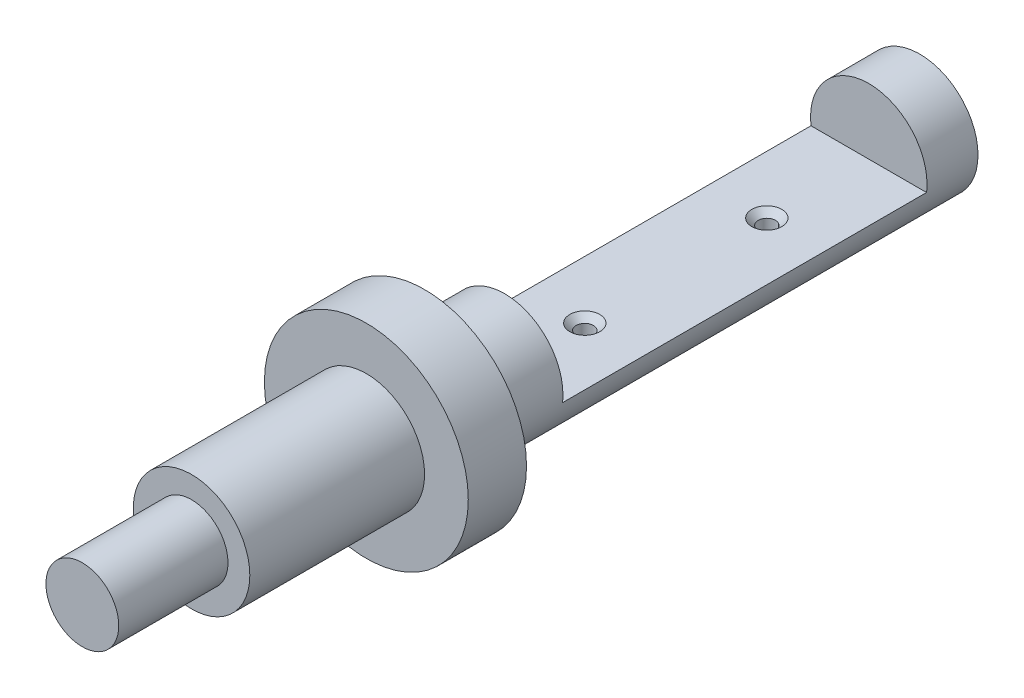
ISO-10303-21;
HEADER;
FILE_DESCRIPTION(('STEP AP214'),'2;1');
FILE_NAME('part.step','',(''),(''),'','','');
FILE_SCHEMA(('AUTOMOTIVE_DESIGN { 1 0 10303 214 1 1 1 1 }'));
ENDSEC;
DATA;
#1=APPLICATION_CONTEXT('core data for automotive mechanical design processes');
#2=APPLICATION_PROTOCOL_DEFINITION('international standard','automotive_design',2000,#1);
#3=PRODUCT_CONTEXT('',#1,'mechanical');
#4=PRODUCT('Part','Part','',(#3));
#5=PRODUCT_RELATED_PRODUCT_CATEGORY('part','',(#4));
#6=PRODUCT_DEFINITION_FORMATION('','',#4);
#7=PRODUCT_DEFINITION_CONTEXT('part definition',#1,'design');
#8=PRODUCT_DEFINITION('design','',#6,#7);
#9=PRODUCT_DEFINITION_SHAPE('','',#8);
#10=(LENGTH_UNIT() NAMED_UNIT(*) SI_UNIT(.MILLI.,.METRE.));
#11=(NAMED_UNIT(*) PLANE_ANGLE_UNIT() SI_UNIT($,.RADIAN.));
#12=(NAMED_UNIT(*) SI_UNIT($,.STERADIAN.) SOLID_ANGLE_UNIT());
#13=UNCERTAINTY_MEASURE_WITH_UNIT(LENGTH_MEASURE(1.E-05),#10,'distance_accuracy_value','');
#14=(GEOMETRIC_REPRESENTATION_CONTEXT(3) GLOBAL_UNCERTAINTY_ASSIGNED_CONTEXT((#13)) GLOBAL_UNIT_ASSIGNED_CONTEXT((#10,
#11,#12)) REPRESENTATION_CONTEXT('',''));
#15=CARTESIAN_POINT('',(0.,0.,0.));
#16=DIRECTION('',(0.,0.,1.));
#17=DIRECTION('',(1.,0.,0.));
#18=AXIS2_PLACEMENT_3D('',#15,#16,#17);
#19=CARTESIAN_POINT('',(0.,0.,34.));
#20=DIRECTION('',(0.,0.,-1.));
#21=DIRECTION('',(-1.,0.,0.));
#22=AXIS2_PLACEMENT_3D('',#19,#20,#21);
#23=CYLINDRICAL_SURFACE('',#22,8.);
#24=CARTESIAN_POINT('',(0.,-8.,13.18745));
#25=CARTESIAN_POINT('',(0.0663087482033811,-7.99999894501209,13.18744725931));
#26=CARTESIAN_POINT('',(0.132656173743971,-7.99916694623629,13.1818771013111));
#27=CARTESIAN_POINT('',(0.263497078716653,-7.99592800887379,13.1597489626041));
#28=CARTESIAN_POINT('',(0.327988679617249,-7.9935195292754,13.1431802305537));
#29=CARTESIAN_POINT('',(0.453205425983684,-7.98739833453829,13.0995604552694));
#30=CARTESIAN_POINT('',(0.5139333576356,-7.98368659808316,13.0725172762774));
#31=CARTESIAN_POINT('',(0.629979888221841,-7.97536921624044,13.0087353503261));
#32=CARTESIAN_POINT('',(0.685299248817819,-7.97076369699322,12.971997971255));
#33=CARTESIAN_POINT('',(0.789391275249504,-7.96113160914156,12.8895707407477));
#34=CARTESIAN_POINT('',(0.838116535854177,-7.95610237418402,12.8438213295778));
#35=CARTESIAN_POINT('',(0.927228275362013,-7.94621059285846,12.7447968459276));
#36=CARTESIAN_POINT('',(0.967614278557428,-7.94134805601284,12.6915213444179));
#37=CARTESIAN_POINT('',(1.03908511700861,-7.93231433212592,12.5786391353847));
#38=CARTESIAN_POINT('',(1.07012418041902,-7.9281465905078,12.519003147994));
#39=CARTESIAN_POINT('',(1.12172755937181,-7.9210106727804,12.3952921876835));
#40=CARTESIAN_POINT('',(1.14229243383083,-7.91804243266586,12.3312174518284));
#41=CARTESIAN_POINT('',(1.17221665360042,-7.91366776117878,12.2009459974442));
#42=CARTESIAN_POINT('',(1.18165708849378,-7.91225003315492,12.1347682919936));
#43=CARTESIAN_POINT('',(1.18931563833385,-7.91110259325201,12.0017540090907));
#44=CARTESIAN_POINT('',(1.18753438441178,-7.91137278644073,11.9349174689038));
#45=CARTESIAN_POINT('',(1.17286640774963,-7.91356032981611,11.8030550620849));
#46=CARTESIAN_POINT('',(1.16006993123018,-7.91546429433811,11.7380189027145));
#47=CARTESIAN_POINT('',(1.12387599416658,-7.92068394369203,11.6110271665926));
#48=CARTESIAN_POINT('',(1.10047823944774,-7.9239996676987,11.5490716753793));
#49=CARTESIAN_POINT('',(1.04365184816744,-7.93168404973752,11.4297249933783));
#50=CARTESIAN_POINT('',(1.0101849186723,-7.93605671459313,11.3723523041544));
#51=CARTESIAN_POINT('',(0.934197460537265,-7.94535937988534,11.2640028837719));
#52=CARTESIAN_POINT('',(0.891676349874277,-7.95028941614145,11.2130265641212));
#53=CARTESIAN_POINT('',(0.798291848354108,-7.96021050048746,11.1183938268324));
#54=CARTESIAN_POINT('',(0.747350853250369,-7.96520167332707,11.0748139664742));
#55=CARTESIAN_POINT('',(0.638837289405928,-7.97463779998068,10.9968104365116));
#56=CARTESIAN_POINT('',(0.58126469270914,-7.97908275149189,10.9623868055082));
#57=CARTESIAN_POINT('',(0.461056338086196,-7.98693011537415,10.9036692215213));
#58=CARTESIAN_POINT('',(0.398417690200602,-7.99033192730269,10.8793810997559));
#59=CARTESIAN_POINT('',(0.269888941365808,-7.99570467491202,10.8416901483312));
#60=CARTESIAN_POINT('',(0.203999055919608,-7.99767570529413,10.828286598231));
#61=CARTESIAN_POINT('',(0.0714990296717954,-7.99995228149022,10.8128468933002));
#62=CARTESIAN_POINT('',(0.00490141015273311,-8.00027324948121,10.8107054735024));
#63=CARTESIAN_POINT('',(-0.127702010956079,-7.99925549396797,10.8175715193873));
#64=CARTESIAN_POINT('',(-0.193707830413773,-7.99791682074365,10.8265786473176));
#65=CARTESIAN_POINT('',(-0.322935698645108,-7.99373973915741,10.8553985815482));
#66=CARTESIAN_POINT('',(-0.386169417671419,-7.99090844032015,10.8751601775316));
#67=CARTESIAN_POINT('',(-0.50842601708223,-7.98406257715895,10.924874136789));
#68=CARTESIAN_POINT('',(-0.567448703137571,-7.98004795827142,10.9548269699967));
#69=CARTESIAN_POINT('',(-0.680071166744436,-7.97124334983544,11.0243206340977));
#70=CARTESIAN_POINT('',(-0.733629262322739,-7.96644803413886,11.0639283282556));
#71=CARTESIAN_POINT('',(-0.833375733721929,-7.95663255175364,11.1515142049128));
#72=CARTESIAN_POINT('',(-0.879563690326868,-7.95161237229547,11.1994928632305));
#73=CARTESIAN_POINT('',(-0.963641154777775,-7.94186415414887,11.3029270243767));
#74=CARTESIAN_POINT('',(-1.00146015110145,-7.93713882206323,11.3584401369775));
#75=CARTESIAN_POINT('',(-1.06723623844724,-7.92856302980426,11.4750928648228));
#76=CARTESIAN_POINT('',(-1.09519359154069,-7.92471254638295,11.5362323304936));
#77=CARTESIAN_POINT('',(-1.14034316959154,-7.91834193722381,11.6621908133552));
#78=CARTESIAN_POINT('',(-1.15757267972105,-7.91581720860529,11.7269962227029));
#79=CARTESIAN_POINT('',(-1.18089625882434,-7.91237166547568,11.8586210634354));
#80=CARTESIAN_POINT('',(-1.18699107940642,-7.91145074270549,11.9254403585703));
#81=CARTESIAN_POINT('',(-1.18785466598699,-7.91132106551878,12.0584935036754));
#82=CARTESIAN_POINT('',(-1.18273429252525,-7.91209555218728,12.124726644458));
#83=CARTESIAN_POINT('',(-1.16155021737211,-7.91523303304493,12.2553787970403));
#84=CARTESIAN_POINT('',(-1.1454865317767,-7.91759602489762,12.3197978115081));
#85=CARTESIAN_POINT('',(-1.10291072354192,-7.92363845312516,12.444963454484));
#86=CARTESIAN_POINT('',(-1.07640618820217,-7.92731693336437,12.5057127128896));
#87=CARTESIAN_POINT('',(-1.01371206095952,-7.93557705576351,12.6219200795363));
#88=CARTESIAN_POINT('',(-0.977522154897857,-7.94015872721845,12.6773780160667));
#89=CARTESIAN_POINT('',(-0.896081213857096,-7.94976293640523,12.7819919896461));
#90=CARTESIAN_POINT('',(-0.850748030462223,-7.9547892207032,12.8310837382069));
#91=CARTESIAN_POINT('',(-0.752480938996389,-7.96468491851204,12.9210026984493));
#92=CARTESIAN_POINT('',(-0.699545265257733,-7.96955429525879,12.9618279849339));
#93=CARTESIAN_POINT('',(-0.587240998054782,-7.9786174236364,13.0342509876264));
#94=CARTESIAN_POINT('',(-0.527839306602324,-7.98280739684649,13.0657978431009));
#95=CARTESIAN_POINT('',(-0.404546657243038,-7.99000251399306,13.118419737412));
#96=CARTESIAN_POINT('',(-0.340660443721612,-7.99300888850096,13.1395056583065));
#97=CARTESIAN_POINT('',(-0.230403820004135,-7.99680919356762,13.1658055316249));
#98=CARTESIAN_POINT('',(-0.18471505570066,-7.99799962230652,13.1739098535637));
#99=CARTESIAN_POINT('',(-0.0926904896549038,-7.99959538955319,13.1847330133001));
#100=CARTESIAN_POINT('',(-0.0463546957103452,-8.0000007375142,13.187451915944));
#101=CARTESIAN_POINT('',(0.,-8.,13.18745));
#102=B_SPLINE_CURVE_WITH_KNOTS('',3,(#24,#25,#26,#27,#28,#29,#30,#31,#32,#33,#34,#35,#36,#37,
#38,#39,#40,#41,#42,#43,#44,#45,#46,#47,#48,#49,#50,#51,#52,#53,#54,#55,#56,#57,#58,#59,#60,#61,
#62,#63,#64,#65,#66,#67,#68,#69,#70,#71,#72,#73,#74,#75,#76,#77,#78,#79,#80,#81,#82,#83,#84,#85,
#86,#87,#88,#89,#90,#91,#92,#93,#94,#95,#96,#97,#98,#99,#100,#101),.UNSPECIFIED.,.T.,.F.,(4,2,2,
2,2,2,2,2,2,2,2,2,2,2,2,2,2,2,2,2,2,2,2,2,2,2,2,2,2,2,2,2,2,2,2,2,2,2,4),(0.,0.198756864090689,
0.397708303954101,0.596510659210654,0.795284977691535,0.995419938242138,1.19556631221499,
1.39667743202899,1.59777781916165,1.79740307109577,1.99701709578881,2.19501110853492,
2.39301061574971,2.59177284019067,2.79054784537296,2.99126908869506,3.19199117820572,
3.39282858959272,3.59365270663385,3.79259637960535,3.99153402559794,4.18953256076507,
4.38754022719161,4.58696019731304,4.78639150646816,4.98744402144124,5.1884911930786,
5.38883565636561,5.58916659560021,5.78752623732373,5.98588558729017,6.18410105589672,
6.38232295468304,6.58241219704049,6.78254798521854,6.98376122319847,7.18476470654093,
7.32371205731247,7.462657734993),.UNSPECIFIED.);
#103=CARTESIAN_POINT('',(0.,-8.,13.18745));
#104=VERTEX_POINT('',#103);
#105=EDGE_CURVE('E42',#104,#104,#102,.T.);
#106=ORIENTED_EDGE('',*,*,#105,.T.);
#107=EDGE_LOOP('',(#106));
#108=FACE_BOUND('',#107,.T.);
#109=CARTESIAN_POINT('',(0.,-8.,-11.81255));
#110=CARTESIAN_POINT('',(0.0663087482033812,-7.99999894501209,-11.81255274069));
#111=CARTESIAN_POINT('',(0.132656173743971,-7.99916694623629,-11.8181228986889));
#112=CARTESIAN_POINT('',(0.263497078716653,-7.99592800887379,-11.8402510373959));
#113=CARTESIAN_POINT('',(0.327988679617249,-7.9935195292754,-11.8568197694463));
#114=CARTESIAN_POINT('',(0.453205425983684,-7.98739833453829,-11.9004395447306));
#115=CARTESIAN_POINT('',(0.5139333576356,-7.98368659808316,-11.9274827237226));
#116=CARTESIAN_POINT('',(0.62997988822184,-7.97536921624044,-11.9912646496739));
#117=CARTESIAN_POINT('',(0.685299248817819,-7.97076369699322,-12.028002028745));
#118=CARTESIAN_POINT('',(0.789391275249503,-7.96113160914156,-12.1104292592523));
#119=CARTESIAN_POINT('',(0.838116535854176,-7.95610237418402,-12.1561786704222));
#120=CARTESIAN_POINT('',(0.927228275362013,-7.94621059285846,-12.2552031540724));
#121=CARTESIAN_POINT('',(0.967614278557428,-7.94134805601284,-12.3084786555821));
#122=CARTESIAN_POINT('',(1.03908511700861,-7.93231433212592,-12.4213608646153));
#123=CARTESIAN_POINT('',(1.07012418041902,-7.9281465905078,-12.480996852006));
#124=CARTESIAN_POINT('',(1.12172755937181,-7.9210106727804,-12.6047078123165));
#125=CARTESIAN_POINT('',(1.14229243383083,-7.91804243266586,-12.6687825481716));
#126=CARTESIAN_POINT('',(1.17221665360042,-7.91366776117878,-12.7990540025558));
#127=CARTESIAN_POINT('',(1.18165708849378,-7.91225003315492,-12.8652317080064));
#128=CARTESIAN_POINT('',(1.18931563833385,-7.911102593252,-12.9982459909093));
#129=CARTESIAN_POINT('',(1.18753438441178,-7.91137278644073,-13.0650825310962));
#130=CARTESIAN_POINT('',(1.17286640774963,-7.91356032981611,-13.1969449379151));
#131=CARTESIAN_POINT('',(1.16006993123018,-7.91546429433811,-13.2619810972855));
#132=CARTESIAN_POINT('',(1.12387599416658,-7.92068394369203,-13.3889728334074));
#133=CARTESIAN_POINT('',(1.10047823944774,-7.9239996676987,-13.4509283246207));
#134=CARTESIAN_POINT('',(1.04365184816744,-7.93168404973752,-13.5702750066217));
#135=CARTESIAN_POINT('',(1.0101849186723,-7.93605671459313,-13.6276476958456));
#136=CARTESIAN_POINT('',(0.934197460537265,-7.94535937988534,-13.7359971162281));
#137=CARTESIAN_POINT('',(0.891676349874277,-7.95028941614145,-13.7869734358788));
#138=CARTESIAN_POINT('',(0.798291848354108,-7.96021050048746,-13.8816061731676));
#139=CARTESIAN_POINT('',(0.747350853250369,-7.96520167332707,-13.9251860335258));
#140=CARTESIAN_POINT('',(0.638837289405928,-7.97463779998068,-14.0031895634884));
#141=CARTESIAN_POINT('',(0.58126469270914,-7.97908275149189,-14.0376131944918));
#142=CARTESIAN_POINT('',(0.461056338086196,-7.98693011537415,-14.0963307784787));
#143=CARTESIAN_POINT('',(0.398417690200602,-7.99033192730269,-14.1206189002441));
#144=CARTESIAN_POINT('',(0.269888941365808,-7.99570467491202,-14.1583098516688));
#145=CARTESIAN_POINT('',(0.203999055919608,-7.99767570529413,-14.171713401769));
#146=CARTESIAN_POINT('',(0.0714990296717954,-7.99995228149022,-14.1871531066998));
#147=CARTESIAN_POINT('',(0.00490141015273312,-8.00027324948121,-14.1892945264976));
#148=CARTESIAN_POINT('',(-0.127702010956079,-7.99925549396797,-14.1824284806127));
#149=CARTESIAN_POINT('',(-0.193707830413773,-7.99791682074365,-14.1734213526824));
#150=CARTESIAN_POINT('',(-0.322935698645108,-7.99373973915741,-14.1446014184518));
#151=CARTESIAN_POINT('',(-0.386169417671419,-7.99090844032015,-14.1248398224684));
#152=CARTESIAN_POINT('',(-0.508426017082229,-7.98406257715895,-14.075125863211));
#153=CARTESIAN_POINT('',(-0.567448703137571,-7.98004795827142,-14.0451730300033));
#154=CARTESIAN_POINT('',(-0.680071166744436,-7.97124334983544,-13.9756793659023));
#155=CARTESIAN_POINT('',(-0.73362926232274,-7.96644803413886,-13.9360716717444));
#156=CARTESIAN_POINT('',(-0.833375733721929,-7.95663255175364,-13.8484857950872));
#157=CARTESIAN_POINT('',(-0.879563690326868,-7.95161237229547,-13.8005071367695));
#158=CARTESIAN_POINT('',(-0.963641154777775,-7.94186415414887,-13.6970729756233));
#159=CARTESIAN_POINT('',(-1.00146015110145,-7.93713882206323,-13.6415598630225));
#160=CARTESIAN_POINT('',(-1.06723623844724,-7.92856302980426,-13.5249071351772));
#161=CARTESIAN_POINT('',(-1.09519359154069,-7.92471254638295,-13.4637676695064));
#162=CARTESIAN_POINT('',(-1.14034316959154,-7.91834193722381,-13.3378091866448));
#163=CARTESIAN_POINT('',(-1.15757267972105,-7.91581720860529,-13.2730037772971));
#164=CARTESIAN_POINT('',(-1.18089625882434,-7.91237166547568,-13.1413789365646));
#165=CARTESIAN_POINT('',(-1.18699107940642,-7.91145074270549,-13.0745596414297));
#166=CARTESIAN_POINT('',(-1.18785466598699,-7.91132106551878,-12.9415064963246));
#167=CARTESIAN_POINT('',(-1.18273429252525,-7.91209555218728,-12.875273355542));
#168=CARTESIAN_POINT('',(-1.16155021737211,-7.91523303304493,-12.7446212029597));
#169=CARTESIAN_POINT('',(-1.1454865317767,-7.91759602489762,-12.6802021884919));
#170=CARTESIAN_POINT('',(-1.10291072354192,-7.92363845312516,-12.555036545516));
#171=CARTESIAN_POINT('',(-1.07640618820217,-7.92731693336437,-12.4942872871104));
#172=CARTESIAN_POINT('',(-1.01371206095952,-7.93557705576351,-12.3780799204637));
#173=CARTESIAN_POINT('',(-0.977522154897857,-7.94015872721845,-12.3226219839333));
#174=CARTESIAN_POINT('',(-0.896081213857096,-7.94976293640523,-12.2180080103539));
#175=CARTESIAN_POINT('',(-0.850748030462223,-7.9547892207032,-12.1689162617931));
#176=CARTESIAN_POINT('',(-0.752480938996389,-7.96468491851204,-12.0789973015507));
#177=CARTESIAN_POINT('',(-0.699545265257733,-7.96955429525879,-12.0381720150661));
#178=CARTESIAN_POINT('',(-0.587240998054782,-7.9786174236364,-11.9657490123736));
#179=CARTESIAN_POINT('',(-0.527839306602324,-7.98280739684649,-11.9342021568991));
#180=CARTESIAN_POINT('',(-0.404546657243038,-7.99000251399306,-11.881580262588));
#181=CARTESIAN_POINT('',(-0.340660443721612,-7.99300888850096,-11.8604943416935));
#182=CARTESIAN_POINT('',(-0.230403820004135,-7.99680919356762,-11.8341944683751));
#183=CARTESIAN_POINT('',(-0.18471505570066,-7.99799962230652,-11.8260901464363));
#184=CARTESIAN_POINT('',(-0.0926904896549038,-7.99959538955319,-11.8152669866999));
#185=CARTESIAN_POINT('',(-0.0463546957103452,-8.0000007375142,-11.812548084056));
#186=CARTESIAN_POINT('',(0.,-8.,-11.81255));
#187=B_SPLINE_CURVE_WITH_KNOTS('',3,(#109,#110,#111,#112,#113,#114,#115,#116,#117,#118,#119,
#120,#121,#122,#123,#124,#125,#126,#127,#128,#129,#130,#131,#132,#133,#134,#135,#136,#137,#138,
#139,#140,#141,#142,#143,#144,#145,#146,#147,#148,#149,#150,#151,#152,#153,#154,#155,#156,#157,
#158,#159,#160,#161,#162,#163,#164,#165,#166,#167,#168,#169,#170,#171,#172,#173,#174,#175,#176,
#177,#178,#179,#180,#181,#182,#183,#184,#185,#186),.UNSPECIFIED.,.T.,.F.,(4,2,2,2,2,2,2,2,2,2,2,
2,2,2,2,2,2,2,2,2,2,2,2,2,2,2,2,2,2,2,2,2,2,2,2,2,2,2,4),(0.,0.198756864090689,
0.397708303954101,0.596510659210652,0.795284977691535,0.995419938242136,1.19556631221499,
1.39667743202899,1.59777781916165,1.79740307109576,1.99701709578881,2.19501110853492,
2.39301061574971,2.59177284019067,2.79054784537296,2.99126908869506,3.19199117820572,
3.39282858959272,3.59365270663385,3.79259637960535,3.99153402559794,4.18953256076507,
4.38754022719161,4.58696019731305,4.78639150646816,4.98744402144124,5.1884911930786,
5.38883565636561,5.58916659560021,5.78752623732373,5.98588558729017,6.18410105589672,
6.38232295468304,6.58241219704049,6.78254798521854,6.98376122319847,7.18476470654093,
7.32371205731247,7.462657734993),.UNSPECIFIED.);
#188=CARTESIAN_POINT('',(0.,-8.,-11.81255));
#189=VERTEX_POINT('',#188);
#190=EDGE_CURVE('E85',#189,#189,#187,.T.);
#191=ORIENTED_EDGE('',*,*,#190,.T.);
#192=EDGE_LOOP('',(#191));
#193=FACE_BOUND('',#192,.T.);
#194=CARTESIAN_POINT('',(0.,0.,23.));
#195=DIRECTION('',(0.,0.,1.));
#196=DIRECTION('',(1.,0.,0.));
#197=AXIS2_PLACEMENT_3D('',#194,#195,#196);
#198=CIRCLE('',#197,8.);
#199=CARTESIAN_POINT('',(7.93725393319377,-1.,23.));
#200=VERTEX_POINT('',#199);
#201=CARTESIAN_POINT('',(-7.93725393319377,-1.,23.));
#202=VERTEX_POINT('',#201);
#203=EDGE_CURVE('E51',#200,#202,#198,.T.);
#204=ORIENTED_EDGE('',*,*,#203,.T.);
#205=DIRECTION('',(0.,0.,-1.));
#206=VECTOR('',#205,1.);
#207=CARTESIAN_POINT('',(-7.93725393319377,-1.,34.));
#208=LINE('',#207,#206);
#209=CARTESIAN_POINT('',(-7.93725393319377,-1.,-27.));
#210=VERTEX_POINT('',#209);
#211=EDGE_CURVE('E11',#202,#210,#208,.T.);
#212=ORIENTED_EDGE('',*,*,#211,.T.);
#213=CARTESIAN_POINT('',(0.,0.,-27.));
#214=DIRECTION('',(0.,0.,-1.));
#215=DIRECTION('',(0.,1.,0.));
#216=AXIS2_PLACEMENT_3D('',#213,#214,#215);
#217=CIRCLE('',#216,8.);
#218=CARTESIAN_POINT('',(7.93725393319377,-1.,-27.));
#219=VERTEX_POINT('',#218);
#220=EDGE_CURVE('E70',#210,#219,#217,.T.);
#221=ORIENTED_EDGE('',*,*,#220,.T.);
#222=DIRECTION('',(0.,0.,-1.));
#223=VECTOR('',#222,1.);
#224=CARTESIAN_POINT('',(7.93725393319377,-1.,34.));
#225=LINE('',#224,#223);
#226=EDGE_CURVE('E75',#219,#200,#225,.F.);
#227=ORIENTED_EDGE('',*,*,#226,.T.);
#228=EDGE_LOOP('',(#204,#212,#221,#227));
#229=FACE_BOUND('',#228,.T.);
#230=CARTESIAN_POINT('',(0.,0.,34.));
#231=DIRECTION('',(0.,0.,1.));
#232=DIRECTION('',(1.,0.,0.));
#233=AXIS2_PLACEMENT_3D('',#230,#231,#232);
#234=CIRCLE('',#233,8.);
#235=CARTESIAN_POINT('',(8.,0.,34.));
#236=VERTEX_POINT('',#235);
#237=EDGE_CURVE('E145',#236,#236,#234,.T.);
#238=ORIENTED_EDGE('',*,*,#237,.F.);
#239=EDGE_LOOP('',(#238));
#240=FACE_BOUND('',#239,.T.);
#241=CARTESIAN_POINT('',(0.,0.,-34.));
#242=DIRECTION('',(0.,0.,1.));
#243=DIRECTION('',(1.,0.,0.));
#244=AXIS2_PLACEMENT_3D('',#241,#242,#243);
#245=CIRCLE('',#244,8.);
#246=CARTESIAN_POINT('',(8.,0.,-34.));
#247=VERTEX_POINT('',#246);
#248=EDGE_CURVE('E143',#247,#247,#245,.T.);
#249=ORIENTED_EDGE('',*,*,#248,.T.);
#250=EDGE_LOOP('',(#249));
#251=FACE_BOUND('',#250,.T.);
#252=ADVANCED_FACE('F38',(#108,#193,#229,#240,#251),#23,.T.);
#253=CARTESIAN_POINT('',(0.,0.,-34.));
#254=DIRECTION('',(0.,0.,1.));
#255=DIRECTION('',(1.,0.,0.));
#256=AXIS2_PLACEMENT_3D('',#253,#254,#255);
#257=PLANE('',#256);
#258=ORIENTED_EDGE('',*,*,#248,.F.);
#259=EDGE_LOOP('',(#258));
#260=FACE_BOUND('',#259,.T.);
#261=ADVANCED_FACE('F133',(#260),#257,.F.);
#262=CARTESIAN_POINT('',(0.,0.,42.));
#263=DIRECTION('',(0.,0.,-1.));
#264=DIRECTION('',(-1.,0.,0.));
#265=AXIS2_PLACEMENT_3D('',#262,#263,#264);
#266=CYLINDRICAL_SURFACE('',#265,14.);
#267=CARTESIAN_POINT('',(0.,0.,42.));
#268=DIRECTION('',(0.,0.,1.));
#269=DIRECTION('',(1.,0.,0.));
#270=AXIS2_PLACEMENT_3D('',#267,#268,#269);
#271=CIRCLE('',#270,14.);
#272=CARTESIAN_POINT('',(14.,0.,42.));
#273=VERTEX_POINT('',#272);
#274=EDGE_CURVE('E146',#273,#273,#271,.T.);
#275=ORIENTED_EDGE('',*,*,#274,.F.);
#276=EDGE_LOOP('',(#275));
#277=FACE_BOUND('',#276,.T.);
#278=CARTESIAN_POINT('',(0.,0.,34.));
#279=DIRECTION('',(0.,0.,1.));
#280=DIRECTION('',(1.,0.,0.));
#281=AXIS2_PLACEMENT_3D('',#278,#279,#280);
#282=CIRCLE('',#281,14.);
#283=CARTESIAN_POINT('',(14.,0.,34.));
#284=VERTEX_POINT('',#283);
#285=EDGE_CURVE('E152',#284,#284,#282,.T.);
#286=ORIENTED_EDGE('',*,*,#285,.T.);
#287=EDGE_LOOP('',(#286));
#288=FACE_BOUND('',#287,.T.);
#289=ADVANCED_FACE('F127',(#277,#288),#266,.T.);
#290=CARTESIAN_POINT('',(0.,0.,42.));
#291=DIRECTION('',(0.,0.,1.));
#292=DIRECTION('',(1.,0.,0.));
#293=AXIS2_PLACEMENT_3D('',#290,#291,#292);
#294=PLANE('',#293);
#295=CARTESIAN_POINT('',(0.,0.,42.));
#296=DIRECTION('',(0.,0.,1.));
#297=DIRECTION('',(1.,0.,0.));
#298=AXIS2_PLACEMENT_3D('',#295,#296,#297);
#299=CIRCLE('',#298,8.);
#300=CARTESIAN_POINT('',(8.,0.,42.));
#301=VERTEX_POINT('',#300);
#302=EDGE_CURVE('E149',#301,#301,#299,.T.);
#303=ORIENTED_EDGE('',*,*,#302,.F.);
#304=EDGE_LOOP('',(#303));
#305=FACE_BOUND('',#304,.T.);
#306=ORIENTED_EDGE('',*,*,#274,.T.);
#307=EDGE_LOOP('',(#306));
#308=FACE_BOUND('',#307,.T.);
#309=ADVANCED_FACE('F124',(#305,#308),#294,.T.);
#310=CARTESIAN_POINT('',(0.,0.,34.));
#311=DIRECTION('',(0.,0.,1.));
#312=DIRECTION('',(1.,0.,0.));
#313=AXIS2_PLACEMENT_3D('',#310,#311,#312);
#314=PLANE('',#313);
#315=ORIENTED_EDGE('',*,*,#237,.T.);
#316=EDGE_LOOP('',(#315));
#317=FACE_BOUND('',#316,.T.);
#318=ORIENTED_EDGE('',*,*,#285,.F.);
#319=EDGE_LOOP('',(#318));
#320=FACE_BOUND('',#319,.T.);
#321=ADVANCED_FACE('F122',(#317,#320),#314,.F.);
#322=CARTESIAN_POINT('',(0.,0.,66.));
#323=DIRECTION('',(0.,0.,-1.));
#324=DIRECTION('',(-1.,0.,0.));
#325=AXIS2_PLACEMENT_3D('',#322,#323,#324);
#326=CYLINDRICAL_SURFACE('',#325,8.);
#327=CARTESIAN_POINT('',(0.,0.,66.));
#328=DIRECTION('',(0.,0.,1.));
#329=DIRECTION('',(1.,0.,0.));
#330=AXIS2_PLACEMENT_3D('',#327,#328,#329);
#331=CIRCLE('',#330,8.);
#332=CARTESIAN_POINT('',(8.,0.,66.));
#333=VERTEX_POINT('',#332);
#334=EDGE_CURVE('E165',#333,#333,#331,.T.);
#335=ORIENTED_EDGE('',*,*,#334,.F.);
#336=EDGE_LOOP('',(#335));
#337=FACE_BOUND('',#336,.T.);
#338=ORIENTED_EDGE('',*,*,#302,.T.);
#339=EDGE_LOOP('',(#338));
#340=FACE_BOUND('',#339,.T.);
#341=ADVANCED_FACE('F118',(#337,#340),#326,.T.);
#342=CARTESIAN_POINT('',(0.,0.,66.));
#343=DIRECTION('',(0.,0.,1.));
#344=DIRECTION('',(1.,0.,0.));
#345=AXIS2_PLACEMENT_3D('',#342,#343,#344);
#346=PLANE('',#345);
#347=CARTESIAN_POINT('',(0.,0.,66.));
#348=DIRECTION('',(0.,0.,1.));
#349=DIRECTION('',(1.,0.,0.));
#350=AXIS2_PLACEMENT_3D('',#347,#348,#349);
#351=CIRCLE('',#350,5.);
#352=CARTESIAN_POINT('',(5.,0.,66.));
#353=VERTEX_POINT('',#352);
#354=EDGE_CURVE('E155',#353,#353,#351,.T.);
#355=ORIENTED_EDGE('',*,*,#354,.F.);
#356=EDGE_LOOP('',(#355));
#357=FACE_BOUND('',#356,.T.);
#358=ORIENTED_EDGE('',*,*,#334,.T.);
#359=EDGE_LOOP('',(#358));
#360=FACE_BOUND('',#359,.T.);
#361=ADVANCED_FACE('F114',(#357,#360),#346,.T.);
#362=CARTESIAN_POINT('',(0.,0.,81.));
#363=DIRECTION('',(0.,0.,-1.));
#364=DIRECTION('',(-1.,0.,0.));
#365=AXIS2_PLACEMENT_3D('',#362,#363,#364);
#366=CYLINDRICAL_SURFACE('',#365,5.);
#367=CARTESIAN_POINT('',(0.,0.,81.));
#368=DIRECTION('',(0.,0.,1.));
#369=DIRECTION('',(1.,0.,0.));
#370=AXIS2_PLACEMENT_3D('',#367,#368,#369);
#371=CIRCLE('',#370,5.);
#372=CARTESIAN_POINT('',(5.,0.,81.));
#373=VERTEX_POINT('',#372);
#374=EDGE_CURVE('E78',#373,#373,#371,.T.);
#375=ORIENTED_EDGE('',*,*,#374,.F.);
#376=EDGE_LOOP('',(#375));
#377=FACE_BOUND('',#376,.T.);
#378=ORIENTED_EDGE('',*,*,#354,.T.);
#379=EDGE_LOOP('',(#378));
#380=FACE_BOUND('',#379,.T.);
#381=ADVANCED_FACE('F110',(#377,#380),#366,.T.);
#382=CARTESIAN_POINT('',(0.,0.,81.));
#383=DIRECTION('',(0.,0.,1.));
#384=DIRECTION('',(1.,0.,0.));
#385=AXIS2_PLACEMENT_3D('',#382,#383,#384);
#386=PLANE('',#385);
#387=ORIENTED_EDGE('',*,*,#374,.T.);
#388=EDGE_LOOP('',(#387));
#389=FACE_BOUND('',#388,.T.);
#390=ADVANCED_FACE('F107',(#389),#386,.T.);
#391=CARTESIAN_POINT('',(-14.,12.1727204457149,23.));
#392=DIRECTION('',(0.,0.,1.));
#393=DIRECTION('',(1.,0.,0.));
#394=AXIS2_PLACEMENT_3D('',#391,#392,#393);
#395=PLANE('',#394);
#396=DIRECTION('',(1.,0.,0.));
#397=VECTOR('',#396,1.);
#398=CARTESIAN_POINT('',(-14.,-1.,23.));
#399=LINE('',#398,#397);
#400=EDGE_CURVE('E59',#202,#200,#399,.T.);
#401=ORIENTED_EDGE('',*,*,#400,.F.);
#402=ORIENTED_EDGE('',*,*,#203,.F.);
#403=EDGE_LOOP('',(#401,#402));
#404=FACE_BOUND('',#403,.T.);
#405=ADVANCED_FACE('F101',(#404),#395,.F.);
#406=CARTESIAN_POINT('',(-14.,12.1727204457149,-27.));
#407=DIRECTION('',(0.,0.,-1.));
#408=DIRECTION('',(0.,1.,0.));
#409=AXIS2_PLACEMENT_3D('',#406,#407,#408);
#410=PLANE('',#409);
#411=DIRECTION('',(1.,0.,0.));
#412=VECTOR('',#411,1.);
#413=CARTESIAN_POINT('',(-14.,-1.,-27.));
#414=LINE('',#413,#412);
#415=EDGE_CURVE('E72',#210,#219,#414,.T.);
#416=ORIENTED_EDGE('',*,*,#415,.T.);
#417=ORIENTED_EDGE('',*,*,#220,.F.);
#418=EDGE_LOOP('',(#416,#417));
#419=FACE_BOUND('',#418,.T.);
#420=ADVANCED_FACE('F71',(#419),#410,.F.);
#421=CARTESIAN_POINT('',(-14.,-1.,23.));
#422=DIRECTION('',(0.,-1.,0.));
#423=DIRECTION('',(0.,0.,-1.));
#424=AXIS2_PLACEMENT_3D('',#421,#422,#423);
#425=PLANE('',#424);
#426=CARTESIAN_POINT('',(0.,-0.999999999999999,12.));
#427=DIRECTION('',(0.,1.,0.));
#428=DIRECTION('',(0.,0.,1.));
#429=AXIS2_PLACEMENT_3D('',#426,#427,#428);
#430=CIRCLE('',#429,2.0574);
#431=CARTESIAN_POINT('',(0.,-0.999999999999999,14.0574));
#432=VERTEX_POINT('',#431);
#433=EDGE_CURVE('E188',#432,#432,#430,.T.);
#434=ORIENTED_EDGE('',*,*,#433,.F.);
#435=EDGE_LOOP('',(#434));
#436=FACE_BOUND('',#435,.T.);
#437=CARTESIAN_POINT('',(0.,-0.999999999999999,-13.));
#438=DIRECTION('',(0.,1.,0.));
#439=DIRECTION('',(0.,0.,1.));
#440=AXIS2_PLACEMENT_3D('',#437,#438,#439);
#441=CIRCLE('',#440,2.0574);
#442=CARTESIAN_POINT('',(0.,-0.999999999999999,-10.9426));
#443=VERTEX_POINT('',#442);
#444=EDGE_CURVE('E182',#443,#443,#441,.T.);
#445=ORIENTED_EDGE('',*,*,#444,.F.);
#446=EDGE_LOOP('',(#445));
#447=FACE_BOUND('',#446,.T.);
#448=ORIENTED_EDGE('',*,*,#400,.T.);
#449=ORIENTED_EDGE('',*,*,#226,.F.);
#450=ORIENTED_EDGE('',*,*,#415,.F.);
#451=ORIENTED_EDGE('',*,*,#211,.F.);
#452=EDGE_LOOP('',(#448,#449,#450,#451));
#453=FACE_BOUND('',#452,.T.);
#454=ADVANCED_FACE('F77',(#436,#447,#453),#425,.F.);
#455=CARTESIAN_POINT('',(0.,-1.,-13.));
#456=DIRECTION('',(0.,1.,0.));
#457=DIRECTION('',(0.,0.,1.));
#458=AXIS2_PLACEMENT_3D('',#455,#456,#457);
#459=CYLINDRICAL_SURFACE('',#458,1.18744999999999);
#460=CARTESIAN_POINT('',(0.,-1.86995,-13.));
#461=DIRECTION('',(0.,1.,0.));
#462=DIRECTION('',(0.,0.,1.));
#463=AXIS2_PLACEMENT_3D('',#460,#461,#462);
#464=CIRCLE('',#463,1.18745);
#465=CARTESIAN_POINT('',(0.,-1.86995,-11.81255));
#466=VERTEX_POINT('',#465);
#467=EDGE_CURVE('E91',#466,#466,#464,.T.);
#468=ORIENTED_EDGE('',*,*,#467,.T.);
#469=EDGE_LOOP('',(#468));
#470=FACE_BOUND('',#469,.T.);
#471=ORIENTED_EDGE('',*,*,#190,.F.);
#472=EDGE_LOOP('',(#471));
#473=FACE_BOUND('',#472,.T.);
#474=ADVANCED_FACE('F92',(#470,#473),#459,.F.);
#475=CARTESIAN_POINT('',(0.,-0.999999999999999,-13.));
#476=DIRECTION('',(0.,1.,0.));
#477=DIRECTION('',(0.,0.,1.));
#478=AXIS2_PLACEMENT_3D('',#475,#476,#477);
#479=CONICAL_SURFACE('',#478,2.0574,0.785398163397448);
#480=ORIENTED_EDGE('',*,*,#467,.F.);
#481=EDGE_LOOP('',(#480));
#482=FACE_BOUND('',#481,.T.);
#483=ORIENTED_EDGE('',*,*,#444,.T.);
#484=EDGE_LOOP('',(#483));
#485=FACE_BOUND('',#484,.T.);
#486=ADVANCED_FACE('F97',(#482,#485),#479,.F.);
#487=CARTESIAN_POINT('',(0.,-1.,12.));
#488=DIRECTION('',(0.,1.,0.));
#489=DIRECTION('',(0.,0.,1.));
#490=AXIS2_PLACEMENT_3D('',#487,#488,#489);
#491=CYLINDRICAL_SURFACE('',#490,1.18744999999999);
#492=CARTESIAN_POINT('',(0.,-1.86995,12.));
#493=DIRECTION('',(0.,1.,0.));
#494=DIRECTION('',(0.,0.,1.));
#495=AXIS2_PLACEMENT_3D('',#492,#493,#494);
#496=CIRCLE('',#495,1.18745);
#497=CARTESIAN_POINT('',(0.,-1.86995,13.18745));
#498=VERTEX_POINT('',#497);
#499=EDGE_CURVE('E185',#498,#498,#496,.T.);
#500=ORIENTED_EDGE('',*,*,#499,.T.);
#501=EDGE_LOOP('',(#500));
#502=FACE_BOUND('',#501,.T.);
#503=ORIENTED_EDGE('',*,*,#105,.F.);
#504=EDGE_LOOP('',(#503));
#505=FACE_BOUND('',#504,.T.);
#506=ADVANCED_FACE('F197',(#502,#505),#491,.F.);
#507=CARTESIAN_POINT('',(0.,-0.999999999999999,12.));
#508=DIRECTION('',(0.,1.,0.));
#509=DIRECTION('',(0.,0.,1.));
#510=AXIS2_PLACEMENT_3D('',#507,#508,#509);
#511=CONICAL_SURFACE('',#510,2.0574,0.785398163397448);
#512=ORIENTED_EDGE('',*,*,#499,.F.);
#513=EDGE_LOOP('',(#512));
#514=FACE_BOUND('',#513,.T.);
#515=ORIENTED_EDGE('',*,*,#433,.T.);
#516=EDGE_LOOP('',(#515));
#517=FACE_BOUND('',#516,.T.);
#518=ADVANCED_FACE('F192',(#514,#517),#511,.F.);
#519=CLOSED_SHELL('',(#252,#261,#289,#309,#321,#341,#361,#381,#390,#405,#420,#454,#474,#486,
#506,#518));
#520=MANIFOLD_SOLID_BREP('B2',#519);
#521=ADVANCED_BREP_SHAPE_REPRESENTATION('',(#18,#520),#14);
#522=SHAPE_DEFINITION_REPRESENTATION(#9,#521);
ENDSEC;
END-ISO-10303-21;
